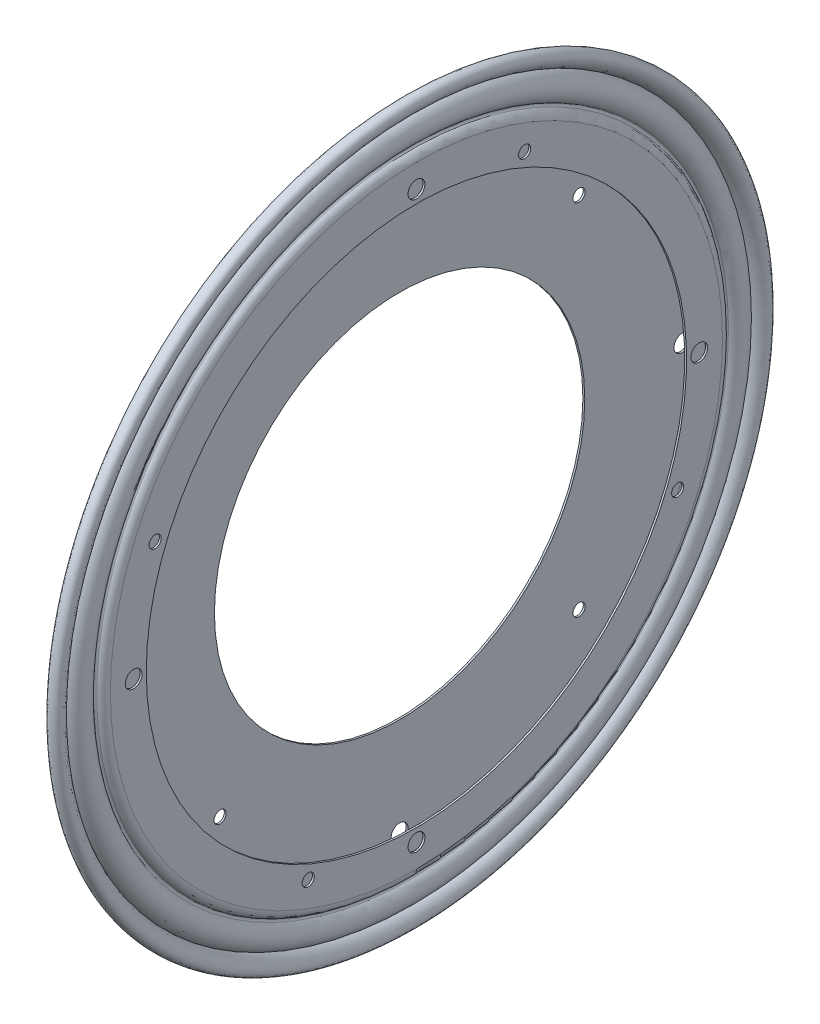
ISO-10303-21;
HEADER;
FILE_DESCRIPTION(('STEP AP214'),'2;1');
FILE_NAME('part.step','',(''),(''),'','','');
FILE_SCHEMA(('AUTOMOTIVE_DESIGN { 1 0 10303 214 1 1 1 1 }'));
ENDSEC;
DATA;
#1=APPLICATION_CONTEXT('core data for automotive mechanical design processes');
#2=APPLICATION_PROTOCOL_DEFINITION('international standard','automotive_design',2000,#1);
#3=PRODUCT_CONTEXT('',#1,'mechanical');
#4=PRODUCT('Part','Part','',(#3));
#5=PRODUCT_RELATED_PRODUCT_CATEGORY('part','',(#4));
#6=PRODUCT_DEFINITION_FORMATION('','',#4);
#7=PRODUCT_DEFINITION_CONTEXT('part definition',#1,'design');
#8=PRODUCT_DEFINITION('design','',#6,#7);
#9=PRODUCT_DEFINITION_SHAPE('','',#8);
#10=(LENGTH_UNIT() NAMED_UNIT(*) SI_UNIT(.MILLI.,.METRE.));
#11=(NAMED_UNIT(*) PLANE_ANGLE_UNIT() SI_UNIT($,.RADIAN.));
#12=(NAMED_UNIT(*) SI_UNIT($,.STERADIAN.) SOLID_ANGLE_UNIT());
#13=UNCERTAINTY_MEASURE_WITH_UNIT(LENGTH_MEASURE(1.E-05),#10,'distance_accuracy_value','');
#14=(GEOMETRIC_REPRESENTATION_CONTEXT(3) GLOBAL_UNCERTAINTY_ASSIGNED_CONTEXT((#13)) GLOBAL_UNIT_ASSIGNED_CONTEXT((#10,
#11,#12)) REPRESENTATION_CONTEXT('',''));
#15=CARTESIAN_POINT('',(0.,0.,0.));
#16=DIRECTION('',(0.,0.,1.));
#17=DIRECTION('',(1.,0.,0.));
#18=AXIS2_PLACEMENT_3D('',#15,#16,#17);
#19=CARTESIAN_POINT('',(-20.7806787586344,-125.372182842589,0.));
#20=DIRECTION('',(1.,0.,0.));
#21=DIRECTION('',(0.,0.,-1.));
#22=AXIS2_PLACEMENT_3D('',#19,#20,#21);
#23=TOROIDAL_SURFACE('',#22,156.907666903698,11.0071865304163);
#24=CARTESIAN_POINT('',(-17.3549548931554,-125.372182842589,0.));
#25=DIRECTION('',(1.,0.,0.));
#26=DIRECTION('',(0.,0.,-1.));
#27=AXIS2_PLACEMENT_3D('',#24,#25,#26);
#28=CIRCLE('',#27,146.447142475503);
#29=CARTESIAN_POINT('',(-17.3549548931554,-125.372182842589,-146.447142475503));
#30=VERTEX_POINT('',#29);
#31=EDGE_CURVE('P0_E10',#30,#30,#28,.T.);
#32=ORIENTED_EDGE('',*,*,#31,.T.);
#33=EDGE_LOOP('',(#32));
#34=FACE_BOUND('',#33,.T.);
#35=CARTESIAN_POINT('',(-17.9016694019906,-125.372182842589,0.));
#36=DIRECTION('',(1.,0.,0.));
#37=DIRECTION('',(0.,0.,-1.));
#38=AXIS2_PLACEMENT_3D('',#35,#36,#37);
#39=CIRCLE('',#38,146.28366292969);
#40=CARTESIAN_POINT('',(-17.9016694019906,-125.372182842589,-146.28366292969));
#41=VERTEX_POINT('',#40);
#42=EDGE_CURVE('P0_E41',#41,#41,#39,.T.);
#43=ORIENTED_EDGE('',*,*,#42,.F.);
#44=EDGE_LOOP('',(#43));
#45=FACE_BOUND('',#44,.T.);
#46=ADVANCED_FACE('P0_F31',(#34,#45),#23,.T.);
#47=CARTESIAN_POINT('',(-17.3549548931554,21.0749596329145,0.));
#48=CARTESIAN_POINT('',(-13.8843389422062,22.21155388043,0.));
#49=CARTESIAN_POINT('',(-13.3298945987826,26.395115924312,0.));
#50=CARTESIAN_POINT('',(-17.2144731093381,27.5448446665488,0.));
#51=CARTESIAN_POINT('',(-17.9016694019901,24.8783484462321,0.));
#52=CARTESIAN_POINT('',(-17.9016694019906,21.801683813341,0.));
#53=B_SPLINE_CURVE_WITH_KNOTS('',3,(#47,#48,#49,#50,#51,#52),.UNSPECIFIED.,.F.,.F.,(4,2,4),(0.,
0.5,1.),.UNSPECIFIED.);
#54=CARTESIAN_POINT('',(-19.8180211094154,-125.372182842589,0.));
#55=DIRECTION('',(1.,0.,0.));
#56=AXIS1_PLACEMENT('',#54,#55);
#57=SURFACE_OF_REVOLUTION('',#53,#56);
#58=CARTESIAN_POINT('',(-17.9016694019906,-125.372182842589,0.));
#59=DIRECTION('',(1.,0.,0.));
#60=DIRECTION('',(0.,0.,-1.));
#61=AXIS2_PLACEMENT_3D('',#58,#59,#60);
#62=CIRCLE('',#61,147.17386665593);
#63=CARTESIAN_POINT('',(-17.9016694019906,-125.372182842589,-147.17386665593));
#64=VERTEX_POINT('',#63);
#65=EDGE_CURVE('P0_E37',#64,#64,#62,.T.);
#66=ORIENTED_EDGE('',*,*,#65,.T.);
#67=EDGE_LOOP('',(#66));
#68=FACE_BOUND('',#67,.T.);
#69=ORIENTED_EDGE('',*,*,#31,.F.);
#70=EDGE_LOOP('',(#69));
#71=FACE_BOUND('',#70,.T.);
#72=ADVANCED_FACE('P0_F53',(#68,#71),#57,.F.);
#73=CARTESIAN_POINT('',(-17.9016694019906,21.8016838133411,0.));
#74=DIRECTION('',(-1.,0.,0.));
#75=DIRECTION('',(0.,0.,1.));
#76=AXIS2_PLACEMENT_3D('',#73,#74,#75);
#77=PLANE('',#76);
#78=ORIENTED_EDGE('',*,*,#42,.T.);
#79=EDGE_LOOP('',(#78));
#80=FACE_BOUND('',#79,.T.);
#81=ORIENTED_EDGE('',*,*,#65,.F.);
#82=EDGE_LOOP('',(#81));
#83=FACE_BOUND('',#82,.T.);
#84=ADVANCED_FACE('P0_F56',(#80,#83),#77,.T.);
#85=CLOSED_SHELL('',(#46,#72,#84));
#86=MANIFOLD_SOLID_BREP('P0_B2',#85);
#87=CARTESIAN_POINT('',(-19.3100196612605,-125.372182842589,0.));
#88=DIRECTION('',(1.,0.,0.));
#89=DIRECTION('',(0.,0.,-1.));
#90=AXIS2_PLACEMENT_3D('',#87,#88,#89);
#91=TOROIDAL_SURFACE('',#90,139.921456642182,6.17720025927117);
#92=CARTESIAN_POINT('',(-17.1079194019906,-125.372182842589,0.));
#93=DIRECTION('',(1.,0.,0.));
#94=DIRECTION('',(0.,1.,0.));
#95=AXIS2_PLACEMENT_3D('',#92,#93,#94);
#96=CIRCLE('',#95,145.692813284364);
#97=CARTESIAN_POINT('',(-17.1079194019906,20.3206304417751,0.));
#98=VERTEX_POINT('',#97);
#99=EDGE_CURVE('P1_E225',#98,#98,#96,.F.);
#100=ORIENTED_EDGE('',*,*,#99,.F.);
#101=EDGE_LOOP('',(#100));
#102=FACE_BOUND('',#101,.T.);
#103=CARTESIAN_POINT('',(-15.4837879251125,-125.372182842589,-4.20150754758772E-13));
#104=DIRECTION('',(1.,0.,0.));
#105=DIRECTION('',(0.,0.,-1.));
#106=AXIS2_PLACEMENT_3D('',#103,#104,#105);
#107=CIRCLE('',#106,135.071945971564);
#108=CARTESIAN_POINT('',(-15.4837879251127,-125.372182842589,-135.071945971565));
#109=VERTEX_POINT('',#108);
#110=EDGE_CURVE('P1_E217',#109,#109,#107,.T.);
#111=ORIENTED_EDGE('',*,*,#110,.F.);
#112=EDGE_LOOP('',(#111));
#113=FACE_BOUND('',#112,.T.);
#114=ADVANCED_FACE('P1_F14',(#102,#113),#91,.T.);
#115=CARTESIAN_POINT('',(-17.1079194019906,20.3206304417751,0.));
#116=CARTESIAN_POINT('',(-13.5609688594263,21.482223370196,0.));
#117=CARTESIAN_POINT('',(-10.2594893705851,27.359305232152,0.));
#118=CARTESIAN_POINT('',(-18.2673052500497,29.8151081640794,0.));
#119=CARTESIAN_POINT('',(-18.8073835861624,24.9252482589153,0.));
#120=CARTESIAN_POINT('',(-18.6954194019905,22.9101467016862,0.));
#121=CARTESIAN_POINT('',(-18.6954194019905,21.801683813341,0.));
#122=(BOUNDED_CURVE() B_SPLINE_CURVE(4,(#115,#116,#117,#118,#119,#120,#121),.UNSPECIFIED.,.F.,
.F.) B_SPLINE_CURVE_WITH_KNOTS((5,1,1,5),(0.,0.579146005992486,0.752139110939153,1.),
.UNSPECIFIED.) CURVE() GEOMETRIC_REPRESENTATION_ITEM() RATIONAL_B_SPLINE_CURVE((1.,1.,1.,1.,1.,
1.,1.)) REPRESENTATION_ITEM(''));
#123=CARTESIAN_POINT('',(-18.6954194019905,-125.372182842589,0.));
#124=DIRECTION('',(1.,0.,0.));
#125=AXIS1_PLACEMENT('',#123,#124);
#126=SURFACE_OF_REVOLUTION('',#122,#125);
#127=ORIENTED_EDGE('',*,*,#99,.T.);
#128=EDGE_LOOP('',(#127));
#129=FACE_BOUND('',#128,.T.);
#130=CARTESIAN_POINT('',(-18.6954194019905,-125.372182842589,0.));
#131=DIRECTION('',(1.,0.,0.));
#132=DIRECTION('',(0.,1.,0.));
#133=AXIS2_PLACEMENT_3D('',#130,#131,#132);
#134=CIRCLE('',#133,147.17386665593);
#135=CARTESIAN_POINT('',(-18.6954194019905,21.801683813341,0.));
#136=VERTEX_POINT('',#135);
#137=EDGE_CURVE('P1_E198',#136,#136,#134,.F.);
#138=ORIENTED_EDGE('',*,*,#137,.F.);
#139=EDGE_LOOP('',(#138));
#140=FACE_BOUND('',#139,.T.);
#141=ADVANCED_FACE('P1_F236',(#129,#140),#126,.F.);
#142=CARTESIAN_POINT('',(-14.9921296797761,-125.372182842589,-3.60822483003176E-13));
#143=DIRECTION('',(1.,0.,0.));
#144=DIRECTION('',(0.,0.,-1.));
#145=AXIS2_PLACEMENT_3D('',#142,#143,#144);
#146=TOROIDAL_SURFACE('',#145,134.448799734881,0.793749999999702);
#147=ORIENTED_EDGE('',*,*,#110,.T.);
#148=EDGE_LOOP('',(#147));
#149=FACE_BOUND('',#148,.T.);
#150=CARTESIAN_POINT('',(-15.344291750717,-125.372182842589,0.));
#151=DIRECTION('',(1.,0.,0.));
#152=DIRECTION('',(0.,0.,-1.));
#153=AXIS2_PLACEMENT_3D('',#150,#151,#152);
#154=CIRCLE('',#153,133.737448247717);
#155=CARTESIAN_POINT('',(-15.344291750717,-125.372182842589,-133.737448247717));
#156=VERTEX_POINT('',#155);
#157=EDGE_CURVE('P1_E195',#156,#156,#154,.T.);
#158=ORIENTED_EDGE('',*,*,#157,.F.);
#159=EDGE_LOOP('',(#158));
#160=FACE_BOUND('',#159,.T.);
#161=ADVANCED_FACE('P1_F240',(#149,#160),#146,.F.);
#162=CARTESIAN_POINT('',(-18.6954194019905,20.6145735626252,0.));
#163=DIRECTION('',(-1.,0.,0.));
#164=DIRECTION('',(0.,0.,1.));
#165=AXIS2_PLACEMENT_3D('',#162,#163,#164);
#166=PLANE('',#165);
#167=CARTESIAN_POINT('',(-18.6954194019905,-125.372182842589,0.));
#168=DIRECTION('',(1.,0.,0.));
#169=DIRECTION('',(0.,0.,-1.));
#170=AXIS2_PLACEMENT_3D('',#167,#168,#169);
#171=CIRCLE('',#170,144.799646154499);
#172=CARTESIAN_POINT('',(-18.6954194019905,-125.372182842589,-144.799646154499));
#173=VERTEX_POINT('',#172);
#174=EDGE_CURVE('P1_E18',#173,#173,#171,.F.);
#175=ORIENTED_EDGE('',*,*,#174,.F.);
#176=EDGE_LOOP('',(#175));
#177=FACE_BOUND('',#176,.T.);
#178=ORIENTED_EDGE('',*,*,#137,.T.);
#179=EDGE_LOOP('',(#178));
#180=FACE_BOUND('',#179,.T.);
#181=ADVANCED_FACE('P1_F188',(#177,#180),#166,.T.);
#182=CARTESIAN_POINT('',(-17.1079194019905,-125.372182842589,0.));
#183=DIRECTION('',(1.,0.,0.));
#184=DIRECTION('',(0.,0.,-1.));
#185=AXIS2_PLACEMENT_3D('',#182,#183,#184);
#186=TOROIDAL_SURFACE('',#185,130.175,3.9751);
#187=ORIENTED_EDGE('',*,*,#157,.T.);
#188=EDGE_LOOP('',(#187));
#189=FACE_BOUND('',#188,.T.);
#190=CARTESIAN_POINT('',(-13.1328194019905,-125.372182842589,0.));
#191=DIRECTION('',(-1.,0.,0.));
#192=DIRECTION('',(0.,1.,0.));
#193=AXIS2_PLACEMENT_3D('',#190,#191,#192);
#194=CIRCLE('',#193,130.175);
#195=CARTESIAN_POINT('',(-13.1328194019905,4.80281715741121,0.));
#196=VERTEX_POINT('',#195);
#197=EDGE_CURVE('P1_E144',#196,#196,#194,.F.);
#198=ORIENTED_EDGE('',*,*,#197,.F.);
#199=EDGE_LOOP('',(#198));
#200=FACE_BOUND('',#199,.T.);
#201=ADVANCED_FACE('P1_F183',(#189,#200),#186,.T.);
#202=CARTESIAN_POINT('',(-14.9058191427206,-125.372182842589,0.));
#203=DIRECTION('',(1.,0.,0.));
#204=DIRECTION('',(0.,0.,-1.));
#205=AXIS2_PLACEMENT_3D('',#202,#203,#204);
#206=TOROIDAL_SURFACE('',#205,139.921456642182,6.17720025927117);
#207=CARTESIAN_POINT('',(-18.7320508788683,-125.372182842589,-7.98234008933115E-13));
#208=DIRECTION('',(-1.,0.,0.));
#209=DIRECTION('',(0.,0.,1.));
#210=AXIS2_PLACEMENT_3D('',#207,#208,#209);
#211=CIRCLE('',#210,135.071945971565);
#212=CARTESIAN_POINT('',(-18.7320508788681,-125.372182842589,135.071945971564));
#213=VERTEX_POINT('',#212);
#214=EDGE_CURVE('P1_E140',#213,#213,#211,.T.);
#215=ORIENTED_EDGE('',*,*,#214,.F.);
#216=EDGE_LOOP('',(#215));
#217=FACE_BOUND('',#216,.T.);
#218=ORIENTED_EDGE('',*,*,#174,.T.);
#219=EDGE_LOOP('',(#218));
#220=FACE_BOUND('',#219,.T.);
#221=ADVANCED_FACE('P1_F177',(#217,#220),#206,.T.);
#222=CARTESIAN_POINT('',(-13.1328194019906,-60.2846828425888,0.));
#223=DIRECTION('',(1.,0.,0.));
#224=DIRECTION('',(0.,0.,-1.));
#225=AXIS2_PLACEMENT_3D('',#222,#223,#224);
#226=PLANE('',#225);
#227=CARTESIAN_POINT('',(-13.1328194019906,-125.372182842589,0.));
#228=DIRECTION('',(-1.,0.,0.));
#229=DIRECTION('',(0.,0.,1.));
#230=AXIS2_PLACEMENT_3D('',#227,#228,#229);
#231=CIRCLE('',#230,114.8969);
#232=CARTESIAN_POINT('',(-13.1328194019906,-125.372182842589,114.8969));
#233=VERTEX_POINT('',#232);
#234=EDGE_CURVE('P1_E115',#233,#233,#231,.T.);
#235=ORIENTED_EDGE('',*,*,#234,.T.);
#236=EDGE_LOOP('',(#235));
#237=FACE_BOUND('',#236,.T.);
#238=CARTESIAN_POINT('',(-13.1328194019906,-5.11588284258878,0.));
#239=DIRECTION('',(1.,0.,0.));
#240=DIRECTION('',(0.,0.,-1.));
#241=AXIS2_PLACEMENT_3D('',#238,#239,#240);
#242=CIRCLE('',#241,3.5687);
#243=CARTESIAN_POINT('',(-13.1328194019906,-5.11588284258878,-3.5687));
#244=VERTEX_POINT('',#243);
#245=EDGE_CURVE('P1_E118',#244,#244,#242,.F.);
#246=ORIENTED_EDGE('',*,*,#245,.T.);
#247=EDGE_LOOP('',(#246));
#248=FACE_BOUND('',#247,.T.);
#249=CARTESIAN_POINT('',(-13.1328194019906,-125.372182842589,-120.2563));
#250=DIRECTION('',(1.,0.,0.));
#251=DIRECTION('',(0.,0.,-1.));
#252=AXIS2_PLACEMENT_3D('',#249,#250,#251);
#253=CIRCLE('',#252,3.56869999999997);
#254=CARTESIAN_POINT('',(-13.1328194019906,-125.372182842589,-123.825));
#255=VERTEX_POINT('',#254);
#256=EDGE_CURVE('P1_E121',#255,#255,#253,.F.);
#257=ORIENTED_EDGE('',*,*,#256,.T.);
#258=EDGE_LOOP('',(#257));
#259=FACE_BOUND('',#258,.T.);
#260=CARTESIAN_POINT('',(-13.1328194019906,-245.628482842589,0.));
#261=DIRECTION('',(1.,0.,0.));
#262=DIRECTION('',(0.,0.,-1.));
#263=AXIS2_PLACEMENT_3D('',#260,#261,#262);
#264=CIRCLE('',#263,3.56870000000005);
#265=CARTESIAN_POINT('',(-13.1328194019906,-245.628482842589,-3.5687));
#266=VERTEX_POINT('',#265);
#267=EDGE_CURVE('P1_E124',#266,#266,#264,.F.);
#268=ORIENTED_EDGE('',*,*,#267,.T.);
#269=EDGE_LOOP('',(#268));
#270=FACE_BOUND('',#269,.T.);
#271=CARTESIAN_POINT('',(-13.1328194019906,-125.372182842589,120.2563));
#272=DIRECTION('',(1.,0.,0.));
#273=DIRECTION('',(0.,0.,-1.));
#274=AXIS2_PLACEMENT_3D('',#271,#272,#273);
#275=CIRCLE('',#274,3.56869999999992);
#276=CARTESIAN_POINT('',(-13.1328194019906,-125.372182842589,116.6876));
#277=VERTEX_POINT('',#276);
#278=EDGE_CURVE('P1_E127',#277,#277,#275,.F.);
#279=ORIENTED_EDGE('',*,*,#278,.T.);
#280=EDGE_LOOP('',(#279));
#281=FACE_BOUND('',#280,.T.);
#282=CARTESIAN_POINT('',(-13.1328194019906,-14.2698486170517,-46.0200936475259));
#283=DIRECTION('',(1.,0.,0.));
#284=DIRECTION('',(0.,0.,-1.));
#285=AXIS2_PLACEMENT_3D('',#282,#283,#284);
#286=CIRCLE('',#285,2.57809999999995);
#287=CARTESIAN_POINT('',(-13.1328194019906,-14.2698486170517,-48.5981936475259));
#288=VERTEX_POINT('',#287);
#289=EDGE_CURVE('P1_E130',#288,#288,#286,.F.);
#290=ORIENTED_EDGE('',*,*,#289,.T.);
#291=EDGE_LOOP('',(#290));
#292=FACE_BOUND('',#291,.T.);
#293=CARTESIAN_POINT('',(-13.1328194019906,-171.392276490115,-111.102334225537));
#294=DIRECTION('',(1.,0.,0.));
#295=DIRECTION('',(0.,0.,-1.));
#296=AXIS2_PLACEMENT_3D('',#293,#294,#295);
#297=CIRCLE('',#296,2.5781);
#298=CARTESIAN_POINT('',(-13.1328194019906,-171.392276490115,-113.680434225537));
#299=VERTEX_POINT('',#298);
#300=EDGE_CURVE('P1_E133',#299,#299,#297,.F.);
#301=ORIENTED_EDGE('',*,*,#300,.T.);
#302=EDGE_LOOP('',(#301));
#303=FACE_BOUND('',#302,.T.);
#304=CARTESIAN_POINT('',(-13.1328194019906,-236.474517068126,46.0200936475259));
#305=DIRECTION('',(1.,0.,0.));
#306=DIRECTION('',(0.,0.,-1.));
#307=AXIS2_PLACEMENT_3D('',#304,#305,#306);
#308=CIRCLE('',#307,2.57809999999995);
#309=CARTESIAN_POINT('',(-13.1328194019906,-236.474517068126,43.441993647526));
#310=VERTEX_POINT('',#309);
#311=EDGE_CURVE('P1_E136',#310,#310,#308,.F.);
#312=ORIENTED_EDGE('',*,*,#311,.T.);
#313=EDGE_LOOP('',(#312));
#314=FACE_BOUND('',#313,.T.);
#315=CARTESIAN_POINT('',(-13.1328194019906,-79.3520891950629,111.102334225537));
#316=DIRECTION('',(1.,0.,0.));
#317=DIRECTION('',(0.,0.,-1.));
#318=AXIS2_PLACEMENT_3D('',#315,#316,#317);
#319=CIRCLE('',#318,2.57810000000005);
#320=CARTESIAN_POINT('',(-13.1328194019906,-79.3520891950629,108.524234225537));
#321=VERTEX_POINT('',#320);
#322=EDGE_CURVE('P1_E138',#321,#321,#319,.F.);
#323=ORIENTED_EDGE('',*,*,#322,.T.);
#324=EDGE_LOOP('',(#323));
#325=FACE_BOUND('',#324,.T.);
#326=ORIENTED_EDGE('',*,*,#197,.T.);
#327=EDGE_LOOP('',(#326));
#328=FACE_BOUND('',#327,.T.);
#329=ADVANCED_FACE('P1_F166',(#237,#248,#259,#270,#281,#292,#303,#314,#325,#328),#226,.T.);
#330=CARTESIAN_POINT('',(-19.2237091242057,-125.372182842589,-8.04911692853238E-13));
#331=DIRECTION('',(1.,0.,0.));
#332=DIRECTION('',(0.,0.,-1.));
#333=AXIS2_PLACEMENT_3D('',#330,#331,#332);
#334=TOROIDAL_SURFACE('',#333,134.448799734881,0.793750000000423);
#335=CARTESIAN_POINT('',(-18.8715470532641,-125.372182842589,0.));
#336=DIRECTION('',(1.,0.,0.));
#337=DIRECTION('',(0.,0.,-1.));
#338=AXIS2_PLACEMENT_3D('',#335,#336,#337);
#339=CIRCLE('',#338,133.737448247717);
#340=CARTESIAN_POINT('',(-18.8715470532641,-125.372182842589,-133.737448247717));
#341=VERTEX_POINT('',#340);
#342=EDGE_CURVE('P1_E114',#341,#341,#339,.F.);
#343=ORIENTED_EDGE('',*,*,#342,.F.);
#344=EDGE_LOOP('',(#343));
#345=FACE_BOUND('',#344,.T.);
#346=ORIENTED_EDGE('',*,*,#214,.T.);
#347=EDGE_LOOP('',(#346));
#348=FACE_BOUND('',#347,.T.);
#349=ADVANCED_FACE('P1_F176',(#345,#348),#334,.F.);
#350=CARTESIAN_POINT('',(-13.5296944019906,-79.3520891950629,111.102334225537));
#351=DIRECTION('',(1.,0.,0.));
#352=DIRECTION('',(0.,0.,-1.));
#353=AXIS2_PLACEMENT_3D('',#350,#351,#352);
#354=CYLINDRICAL_SURFACE('',#353,2.57810000000005);
#355=CARTESIAN_POINT('',(-13.9265694019906,-79.3520891950629,111.102334225537));
#356=DIRECTION('',(1.,0.,0.));
#357=DIRECTION('',(0.,0.,-1.));
#358=AXIS2_PLACEMENT_3D('',#355,#356,#357);
#359=CIRCLE('',#358,2.57810000000005);
#360=CARTESIAN_POINT('',(-13.9265694019906,-79.3520891950629,108.524234225537));
#361=VERTEX_POINT('',#360);
#362=EDGE_CURVE('P1_E111',#361,#361,#359,.T.);
#363=ORIENTED_EDGE('',*,*,#362,.F.);
#364=EDGE_LOOP('',(#363));
#365=FACE_BOUND('',#364,.T.);
#366=ORIENTED_EDGE('',*,*,#322,.F.);
#367=EDGE_LOOP('',(#366));
#368=FACE_BOUND('',#367,.T.);
#369=ADVANCED_FACE('P1_F179',(#365,#368),#354,.F.);
#370=CARTESIAN_POINT('',(-13.5296944019906,-236.474517068126,46.0200936475259));
#371=DIRECTION('',(1.,0.,0.));
#372=DIRECTION('',(0.,0.,-1.));
#373=AXIS2_PLACEMENT_3D('',#370,#371,#372);
#374=CYLINDRICAL_SURFACE('',#373,2.57809999999995);
#375=CARTESIAN_POINT('',(-13.9265694019906,-236.474517068126,46.0200936475259));
#376=DIRECTION('',(1.,0.,0.));
#377=DIRECTION('',(0.,0.,-1.));
#378=AXIS2_PLACEMENT_3D('',#375,#376,#377);
#379=CIRCLE('',#378,2.57809999999995);
#380=CARTESIAN_POINT('',(-13.9265694019906,-236.474517068126,43.441993647526));
#381=VERTEX_POINT('',#380);
#382=EDGE_CURVE('P1_E108',#381,#381,#379,.T.);
#383=ORIENTED_EDGE('',*,*,#382,.F.);
#384=EDGE_LOOP('',(#383));
#385=FACE_BOUND('',#384,.T.);
#386=ORIENTED_EDGE('',*,*,#311,.F.);
#387=EDGE_LOOP('',(#386));
#388=FACE_BOUND('',#387,.T.);
#389=ADVANCED_FACE('P1_F261',(#385,#388),#374,.F.);
#390=CARTESIAN_POINT('',(-13.5296944019906,-171.392276490115,-111.102334225537));
#391=DIRECTION('',(1.,0.,0.));
#392=DIRECTION('',(0.,0.,-1.));
#393=AXIS2_PLACEMENT_3D('',#390,#391,#392);
#394=CYLINDRICAL_SURFACE('',#393,2.5781);
#395=CARTESIAN_POINT('',(-13.9265694019906,-171.392276490115,-111.102334225537));
#396=DIRECTION('',(1.,0.,0.));
#397=DIRECTION('',(0.,0.,-1.));
#398=AXIS2_PLACEMENT_3D('',#395,#396,#397);
#399=CIRCLE('',#398,2.5781);
#400=CARTESIAN_POINT('',(-13.9265694019906,-171.392276490115,-113.680434225537));
#401=VERTEX_POINT('',#400);
#402=EDGE_CURVE('P1_E105',#401,#401,#399,.T.);
#403=ORIENTED_EDGE('',*,*,#402,.F.);
#404=EDGE_LOOP('',(#403));
#405=FACE_BOUND('',#404,.T.);
#406=ORIENTED_EDGE('',*,*,#300,.F.);
#407=EDGE_LOOP('',(#406));
#408=FACE_BOUND('',#407,.T.);
#409=ADVANCED_FACE('P1_F355',(#405,#408),#394,.F.);
#410=CARTESIAN_POINT('',(-13.5296944019906,-14.2698486170517,-46.0200936475259));
#411=DIRECTION('',(1.,0.,0.));
#412=DIRECTION('',(0.,0.,-1.));
#413=AXIS2_PLACEMENT_3D('',#410,#411,#412);
#414=CYLINDRICAL_SURFACE('',#413,2.57809999999995);
#415=CARTESIAN_POINT('',(-13.9265694019906,-14.2698486170517,-46.0200936475259));
#416=DIRECTION('',(1.,0.,0.));
#417=DIRECTION('',(0.,0.,-1.));
#418=AXIS2_PLACEMENT_3D('',#415,#416,#417);
#419=CIRCLE('',#418,2.57809999999995);
#420=CARTESIAN_POINT('',(-13.9265694019906,-14.2698486170517,-48.5981936475259));
#421=VERTEX_POINT('',#420);
#422=EDGE_CURVE('P1_E102',#421,#421,#419,.T.);
#423=ORIENTED_EDGE('',*,*,#422,.F.);
#424=EDGE_LOOP('',(#423));
#425=FACE_BOUND('',#424,.T.);
#426=ORIENTED_EDGE('',*,*,#289,.F.);
#427=EDGE_LOOP('',(#426));
#428=FACE_BOUND('',#427,.T.);
#429=ADVANCED_FACE('P1_F351',(#425,#428),#414,.F.);
#430=CARTESIAN_POINT('',(-13.5296944019906,-125.372182842589,120.2563));
#431=DIRECTION('',(1.,0.,0.));
#432=DIRECTION('',(0.,0.,-1.));
#433=AXIS2_PLACEMENT_3D('',#430,#431,#432);
#434=CYLINDRICAL_SURFACE('',#433,3.56869999999992);
#435=CARTESIAN_POINT('',(-13.9265694019906,-125.372182842589,120.2563));
#436=DIRECTION('',(1.,0.,0.));
#437=DIRECTION('',(0.,0.,-1.));
#438=AXIS2_PLACEMENT_3D('',#435,#436,#437);
#439=CIRCLE('',#438,3.56869999999992);
#440=CARTESIAN_POINT('',(-13.9265694019906,-125.372182842589,116.6876));
#441=VERTEX_POINT('',#440);
#442=EDGE_CURVE('P1_E99',#441,#441,#439,.T.);
#443=ORIENTED_EDGE('',*,*,#442,.F.);
#444=EDGE_LOOP('',(#443));
#445=FACE_BOUND('',#444,.T.);
#446=ORIENTED_EDGE('',*,*,#278,.F.);
#447=EDGE_LOOP('',(#446));
#448=FACE_BOUND('',#447,.T.);
#449=ADVANCED_FACE('P1_F347',(#445,#448),#434,.F.);
#450=CARTESIAN_POINT('',(-13.5296944019906,-245.628482842589,0.));
#451=DIRECTION('',(1.,0.,0.));
#452=DIRECTION('',(0.,0.,-1.));
#453=AXIS2_PLACEMENT_3D('',#450,#451,#452);
#454=CYLINDRICAL_SURFACE('',#453,3.56870000000005);
#455=CARTESIAN_POINT('',(-13.9265694019906,-245.628482842589,0.));
#456=DIRECTION('',(1.,0.,0.));
#457=DIRECTION('',(0.,0.,-1.));
#458=AXIS2_PLACEMENT_3D('',#455,#456,#457);
#459=CIRCLE('',#458,3.56870000000005);
#460=CARTESIAN_POINT('',(-13.9265694019906,-245.628482842589,-3.5687));
#461=VERTEX_POINT('',#460);
#462=EDGE_CURVE('P1_E96',#461,#461,#459,.T.);
#463=ORIENTED_EDGE('',*,*,#462,.F.);
#464=EDGE_LOOP('',(#463));
#465=FACE_BOUND('',#464,.T.);
#466=ORIENTED_EDGE('',*,*,#267,.F.);
#467=EDGE_LOOP('',(#466));
#468=FACE_BOUND('',#467,.T.);
#469=ADVANCED_FACE('P1_F343',(#465,#468),#454,.F.);
#470=CARTESIAN_POINT('',(-13.5296944019906,-125.372182842589,-120.2563));
#471=DIRECTION('',(1.,0.,0.));
#472=DIRECTION('',(0.,0.,-1.));
#473=AXIS2_PLACEMENT_3D('',#470,#471,#472);
#474=CYLINDRICAL_SURFACE('',#473,3.56869999999997);
#475=CARTESIAN_POINT('',(-13.9265694019906,-125.372182842589,-120.2563));
#476=DIRECTION('',(1.,0.,0.));
#477=DIRECTION('',(0.,0.,-1.));
#478=AXIS2_PLACEMENT_3D('',#475,#476,#477);
#479=CIRCLE('',#478,3.56869999999997);
#480=CARTESIAN_POINT('',(-13.9265694019906,-125.372182842589,-123.825));
#481=VERTEX_POINT('',#480);
#482=EDGE_CURVE('P1_E93',#481,#481,#479,.T.);
#483=ORIENTED_EDGE('',*,*,#482,.F.);
#484=EDGE_LOOP('',(#483));
#485=FACE_BOUND('',#484,.T.);
#486=ORIENTED_EDGE('',*,*,#256,.F.);
#487=EDGE_LOOP('',(#486));
#488=FACE_BOUND('',#487,.T.);
#489=ADVANCED_FACE('P1_F339',(#485,#488),#474,.F.);
#490=CARTESIAN_POINT('',(-13.5296944019906,-5.11588284258878,0.));
#491=DIRECTION('',(1.,0.,0.));
#492=DIRECTION('',(0.,0.,-1.));
#493=AXIS2_PLACEMENT_3D('',#490,#491,#492);
#494=CYLINDRICAL_SURFACE('',#493,3.5687);
#495=CARTESIAN_POINT('',(-13.9265694019906,-5.11588284258878,0.));
#496=DIRECTION('',(1.,0.,0.));
#497=DIRECTION('',(0.,0.,-1.));
#498=AXIS2_PLACEMENT_3D('',#495,#496,#497);
#499=CIRCLE('',#498,3.5687);
#500=CARTESIAN_POINT('',(-13.9265694019906,-5.11588284258878,-3.5687));
#501=VERTEX_POINT('',#500);
#502=EDGE_CURVE('P1_E90',#501,#501,#499,.T.);
#503=ORIENTED_EDGE('',*,*,#502,.F.);
#504=EDGE_LOOP('',(#503));
#505=FACE_BOUND('',#504,.T.);
#506=ORIENTED_EDGE('',*,*,#245,.F.);
#507=EDGE_LOOP('',(#506));
#508=FACE_BOUND('',#507,.T.);
#509=ADVANCED_FACE('P1_F335',(#505,#508),#494,.F.);
#510=CARTESIAN_POINT('',(-13.1328194019906,-125.372182842589,0.));
#511=DIRECTION('',(-1.,0.,0.));
#512=DIRECTION('',(0.,0.,1.));
#513=AXIS2_PLACEMENT_3D('',#510,#511,#512);
#514=CYLINDRICAL_SURFACE('',#513,114.8969);
#515=CARTESIAN_POINT('',(-13.9265694019906,-125.372182842589,0.));
#516=DIRECTION('',(-1.,0.,0.));
#517=DIRECTION('',(0.,0.,1.));
#518=AXIS2_PLACEMENT_3D('',#515,#516,#517);
#519=CIRCLE('',#518,114.8969);
#520=CARTESIAN_POINT('',(-13.9265694019906,-125.372182842589,114.8969));
#521=VERTEX_POINT('',#520);
#522=EDGE_CURVE('P1_E87',#521,#521,#519,.F.);
#523=ORIENTED_EDGE('',*,*,#522,.F.);
#524=EDGE_LOOP('',(#523));
#525=FACE_BOUND('',#524,.T.);
#526=ORIENTED_EDGE('',*,*,#234,.F.);
#527=EDGE_LOOP('',(#526));
#528=FACE_BOUND('',#527,.T.);
#529=ADVANCED_FACE('P1_F331',(#525,#528),#514,.F.);
#530=CARTESIAN_POINT('',(-17.1079194019905,-125.372182842589,0.));
#531=DIRECTION('',(1.,0.,0.));
#532=DIRECTION('',(0.,0.,-1.));
#533=AXIS2_PLACEMENT_3D('',#530,#531,#532);
#534=TOROIDAL_SURFACE('',#533,130.175,3.97509999999998);
#535=CARTESIAN_POINT('',(-21.0830194019905,-125.372182842589,0.));
#536=DIRECTION('',(1.,0.,0.));
#537=DIRECTION('',(0.,1.,0.));
#538=AXIS2_PLACEMENT_3D('',#535,#536,#537);
#539=CIRCLE('',#538,130.175);
#540=CARTESIAN_POINT('',(-21.0830194019905,4.80281715741121,0.));
#541=VERTEX_POINT('',#540);
#542=EDGE_CURVE('P1_E86',#541,#541,#539,.F.);
#543=ORIENTED_EDGE('',*,*,#542,.F.);
#544=EDGE_LOOP('',(#543));
#545=FACE_BOUND('',#544,.T.);
#546=ORIENTED_EDGE('',*,*,#342,.T.);
#547=EDGE_LOOP('',(#546));
#548=FACE_BOUND('',#547,.T.);
#549=ADVANCED_FACE('P1_F327',(#545,#548),#534,.T.);
#550=CARTESIAN_POINT('',(-13.9265694019906,-60.2846828425888,0.));
#551=DIRECTION('',(-1.,0.,0.));
#552=DIRECTION('',(0.,0.,1.));
#553=AXIS2_PLACEMENT_3D('',#550,#551,#552);
#554=PLANE('',#553);
#555=ORIENTED_EDGE('',*,*,#522,.T.);
#556=EDGE_LOOP('',(#555));
#557=FACE_BOUND('',#556,.T.);
#558=ORIENTED_EDGE('',*,*,#502,.T.);
#559=EDGE_LOOP('',(#558));
#560=FACE_BOUND('',#559,.T.);
#561=ORIENTED_EDGE('',*,*,#482,.T.);
#562=EDGE_LOOP('',(#561));
#563=FACE_BOUND('',#562,.T.);
#564=ORIENTED_EDGE('',*,*,#462,.T.);
#565=EDGE_LOOP('',(#564));
#566=FACE_BOUND('',#565,.T.);
#567=ORIENTED_EDGE('',*,*,#442,.T.);
#568=EDGE_LOOP('',(#567));
#569=FACE_BOUND('',#568,.T.);
#570=ORIENTED_EDGE('',*,*,#422,.T.);
#571=EDGE_LOOP('',(#570));
#572=FACE_BOUND('',#571,.T.);
#573=ORIENTED_EDGE('',*,*,#402,.T.);
#574=EDGE_LOOP('',(#573));
#575=FACE_BOUND('',#574,.T.);
#576=ORIENTED_EDGE('',*,*,#382,.T.);
#577=EDGE_LOOP('',(#576));
#578=FACE_BOUND('',#577,.T.);
#579=ORIENTED_EDGE('',*,*,#362,.T.);
#580=EDGE_LOOP('',(#579));
#581=FACE_BOUND('',#580,.T.);
#582=CARTESIAN_POINT('',(-13.9265694019906,-125.372182842589,0.));
#583=DIRECTION('',(1.,0.,0.));
#584=DIRECTION('',(0.,0.,-1.));
#585=AXIS2_PLACEMENT_3D('',#582,#583,#584);
#586=CIRCLE('',#585,130.175);
#587=CARTESIAN_POINT('',(-13.9265694019903,-125.372182842589,-130.175));
#588=VERTEX_POINT('',#587);
#589=EDGE_CURVE('P1_E83',#588,#588,#586,.T.);
#590=ORIENTED_EDGE('',*,*,#589,.F.);
#591=EDGE_LOOP('',(#590));
#592=FACE_BOUND('',#591,.T.);
#593=ADVANCED_FACE('P1_F311',(#557,#560,#563,#566,#569,#572,#575,#578,#581,#592),#554,.T.);
#594=CARTESIAN_POINT('',(-21.0830194019906,-60.2846828425888,0.));
#595=DIRECTION('',(-1.,0.,0.));
#596=DIRECTION('',(0.,0.,1.));
#597=AXIS2_PLACEMENT_3D('',#594,#595,#596);
#598=PLANE('',#597);
#599=CARTESIAN_POINT('',(-21.0830194019906,-49.0400058135011,76.3321770290878));
#600=DIRECTION('',(1.,0.,0.));
#601=DIRECTION('',(0.,0.,-1.));
#602=AXIS2_PLACEMENT_3D('',#599,#600,#601);
#603=CIRCLE('',#602,2.5781);
#604=CARTESIAN_POINT('',(-21.0830194019906,-49.0400058135011,73.7540770290878));
#605=VERTEX_POINT('',#604);
#606=EDGE_CURVE('P1_E56',#605,#605,#603,.T.);
#607=ORIENTED_EDGE('',*,*,#606,.T.);
#608=EDGE_LOOP('',(#607));
#609=FACE_BOUND('',#608,.T.);
#610=CARTESIAN_POINT('',(-21.0830194019906,-201.704359871677,76.3321770290878));
#611=DIRECTION('',(1.,0.,0.));
#612=DIRECTION('',(0.,0.,-1.));
#613=AXIS2_PLACEMENT_3D('',#610,#611,#612);
#614=CIRCLE('',#613,2.5781);
#615=CARTESIAN_POINT('',(-21.0830194019906,-201.704359871677,73.7540770290878));
#616=VERTEX_POINT('',#615);
#617=EDGE_CURVE('P1_E59',#616,#616,#614,.T.);
#618=ORIENTED_EDGE('',*,*,#617,.T.);
#619=EDGE_LOOP('',(#618));
#620=FACE_BOUND('',#619,.T.);
#621=CARTESIAN_POINT('',(-21.0830194019906,-201.704359871677,-76.3321770290879));
#622=DIRECTION('',(1.,0.,0.));
#623=DIRECTION('',(0.,0.,-1.));
#624=AXIS2_PLACEMENT_3D('',#621,#622,#623);
#625=CIRCLE('',#624,2.5781);
#626=CARTESIAN_POINT('',(-21.0830194019906,-201.704359871677,-78.9102770290879));
#627=VERTEX_POINT('',#626);
#628=EDGE_CURVE('P1_E62',#627,#627,#625,.T.);
#629=ORIENTED_EDGE('',*,*,#628,.T.);
#630=EDGE_LOOP('',(#629));
#631=FACE_BOUND('',#630,.T.);
#632=CARTESIAN_POINT('',(-21.0830194019906,-49.040005813501,-76.3321770290878));
#633=DIRECTION('',(1.,0.,0.));
#634=DIRECTION('',(0.,0.,-1.));
#635=AXIS2_PLACEMENT_3D('',#632,#633,#634);
#636=CIRCLE('',#635,2.5781);
#637=CARTESIAN_POINT('',(-21.0830194019906,-49.040005813501,-78.9102770290878));
#638=VERTEX_POINT('',#637);
#639=EDGE_CURVE('P1_E65',#638,#638,#636,.T.);
#640=ORIENTED_EDGE('',*,*,#639,.T.);
#641=EDGE_LOOP('',(#640));
#642=FACE_BOUND('',#641,.T.);
#643=CARTESIAN_POINT('',(-21.0830194019906,-125.372182842589,120.2563));
#644=DIRECTION('',(1.,0.,0.));
#645=DIRECTION('',(0.,0.,-1.));
#646=AXIS2_PLACEMENT_3D('',#643,#644,#645);
#647=CIRCLE('',#646,3.56869999999992);
#648=CARTESIAN_POINT('',(-21.0830194019906,-125.372182842589,116.6876));
#649=VERTEX_POINT('',#648);
#650=EDGE_CURVE('P1_E68',#649,#649,#647,.T.);
#651=ORIENTED_EDGE('',*,*,#650,.T.);
#652=EDGE_LOOP('',(#651));
#653=FACE_BOUND('',#652,.T.);
#654=CARTESIAN_POINT('',(-21.0830194019906,-245.628482842589,0.));
#655=DIRECTION('',(1.,0.,0.));
#656=DIRECTION('',(0.,0.,-1.));
#657=AXIS2_PLACEMENT_3D('',#654,#655,#656);
#658=CIRCLE('',#657,3.56870000000005);
#659=CARTESIAN_POINT('',(-21.0830194019906,-245.628482842589,-3.5687));
#660=VERTEX_POINT('',#659);
#661=EDGE_CURVE('P1_E71',#660,#660,#658,.T.);
#662=ORIENTED_EDGE('',*,*,#661,.T.);
#663=EDGE_LOOP('',(#662));
#664=FACE_BOUND('',#663,.T.);
#665=CARTESIAN_POINT('',(-21.0830194019906,-125.372182842589,-120.2563));
#666=DIRECTION('',(1.,0.,0.));
#667=DIRECTION('',(0.,0.,-1.));
#668=AXIS2_PLACEMENT_3D('',#665,#666,#667);
#669=CIRCLE('',#668,3.56869999999997);
#670=CARTESIAN_POINT('',(-21.0830194019906,-125.372182842589,-123.825));
#671=VERTEX_POINT('',#670);
#672=EDGE_CURVE('P1_E74',#671,#671,#669,.T.);
#673=ORIENTED_EDGE('',*,*,#672,.T.);
#674=EDGE_LOOP('',(#673));
#675=FACE_BOUND('',#674,.T.);
#676=CARTESIAN_POINT('',(-21.0830194019906,-5.11588284258878,0.));
#677=DIRECTION('',(1.,0.,0.));
#678=DIRECTION('',(0.,0.,-1.));
#679=AXIS2_PLACEMENT_3D('',#676,#677,#678);
#680=CIRCLE('',#679,3.5687);
#681=CARTESIAN_POINT('',(-21.0830194019906,-5.11588284258878,-3.5687));
#682=VERTEX_POINT('',#681);
#683=EDGE_CURVE('P1_E77',#682,#682,#680,.T.);
#684=ORIENTED_EDGE('',*,*,#683,.T.);
#685=EDGE_LOOP('',(#684));
#686=FACE_BOUND('',#685,.T.);
#687=CARTESIAN_POINT('',(-21.0830194019906,-125.372182842589,0.));
#688=DIRECTION('',(-1.,0.,0.));
#689=DIRECTION('',(0.,0.,1.));
#690=AXIS2_PLACEMENT_3D('',#687,#688,#689);
#691=CIRCLE('',#690,78.7527);
#692=CARTESIAN_POINT('',(-21.0830194019906,-125.372182842589,78.7527));
#693=VERTEX_POINT('',#692);
#694=EDGE_CURVE('P1_E80',#693,#693,#691,.F.);
#695=ORIENTED_EDGE('',*,*,#694,.T.);
#696=EDGE_LOOP('',(#695));
#697=FACE_BOUND('',#696,.T.);
#698=ORIENTED_EDGE('',*,*,#542,.T.);
#699=EDGE_LOOP('',(#698));
#700=FACE_BOUND('',#699,.T.);
#701=ADVANCED_FACE('P1_F307',(#609,#620,#631,#642,#653,#664,#675,#686,#697,#700),#598,.T.);
#702=CARTESIAN_POINT('',(-17.1079194019905,-125.372182842589,0.));
#703=DIRECTION('',(1.,0.,0.));
#704=DIRECTION('',(0.,0.,-1.));
#705=AXIS2_PLACEMENT_3D('',#702,#703,#704);
#706=TOROIDAL_SURFACE('',#705,130.175,3.18134999999992);
#707=ORIENTED_EDGE('',*,*,#589,.T.);
#708=EDGE_LOOP('',(#707));
#709=FACE_BOUND('',#708,.T.);
#710=CARTESIAN_POINT('',(-20.2892694019904,-125.372182842589,0.));
#711=DIRECTION('',(1.,0.,0.));
#712=DIRECTION('',(0.,0.,-1.));
#713=AXIS2_PLACEMENT_3D('',#710,#711,#712);
#714=CIRCLE('',#713,130.175);
#715=CARTESIAN_POINT('',(-20.2892694019902,-125.372182842589,-130.175));
#716=VERTEX_POINT('',#715);
#717=EDGE_CURVE('P1_E53',#716,#716,#714,.T.);
#718=ORIENTED_EDGE('',*,*,#717,.F.);
#719=EDGE_LOOP('',(#718));
#720=FACE_BOUND('',#719,.T.);
#721=ADVANCED_FACE('P1_F16',(#709,#720),#706,.F.);
#722=CARTESIAN_POINT('',(-20.2892694019906,-125.372182842589,0.));
#723=DIRECTION('',(-1.,0.,0.));
#724=DIRECTION('',(0.,0.,1.));
#725=AXIS2_PLACEMENT_3D('',#722,#723,#724);
#726=CYLINDRICAL_SURFACE('',#725,78.7527);
#727=CARTESIAN_POINT('',(-20.2892694019906,-125.372182842589,0.));
#728=DIRECTION('',(-1.,0.,0.));
#729=DIRECTION('',(0.,0.,1.));
#730=AXIS2_PLACEMENT_3D('',#727,#728,#729);
#731=CIRCLE('',#730,78.7527);
#732=CARTESIAN_POINT('',(-20.2892694019906,-125.372182842589,78.7527));
#733=VERTEX_POINT('',#732);
#734=EDGE_CURVE('P1_E50',#733,#733,#731,.T.);
#735=ORIENTED_EDGE('',*,*,#734,.F.);
#736=EDGE_LOOP('',(#735));
#737=FACE_BOUND('',#736,.T.);
#738=ORIENTED_EDGE('',*,*,#694,.F.);
#739=EDGE_LOOP('',(#738));
#740=FACE_BOUND('',#739,.T.);
#741=ADVANCED_FACE('P1_F302',(#737,#740),#726,.F.);
#742=CARTESIAN_POINT('',(-20.6861444019906,-5.11588284258878,0.));
#743=DIRECTION('',(1.,0.,0.));
#744=DIRECTION('',(0.,0.,-1.));
#745=AXIS2_PLACEMENT_3D('',#742,#743,#744);
#746=CYLINDRICAL_SURFACE('',#745,3.5687);
#747=ORIENTED_EDGE('',*,*,#683,.F.);
#748=EDGE_LOOP('',(#747));
#749=FACE_BOUND('',#748,.T.);
#750=CARTESIAN_POINT('',(-20.2892694019906,-5.11588284258878,0.));
#751=DIRECTION('',(1.,0.,0.));
#752=DIRECTION('',(0.,0.,-1.));
#753=AXIS2_PLACEMENT_3D('',#750,#751,#752);
#754=CIRCLE('',#753,3.5687);
#755=CARTESIAN_POINT('',(-20.2892694019906,-5.11588284258878,-3.5687));
#756=VERTEX_POINT('',#755);
#757=EDGE_CURVE('P1_E47',#756,#756,#754,.F.);
#758=ORIENTED_EDGE('',*,*,#757,.F.);
#759=EDGE_LOOP('',(#758));
#760=FACE_BOUND('',#759,.T.);
#761=ADVANCED_FACE('P1_F298',(#749,#760),#746,.F.);
#762=CARTESIAN_POINT('',(-20.6861444019906,-125.372182842589,-120.2563));
#763=DIRECTION('',(1.,0.,0.));
#764=DIRECTION('',(0.,0.,-1.));
#765=AXIS2_PLACEMENT_3D('',#762,#763,#764);
#766=CYLINDRICAL_SURFACE('',#765,3.56869999999997);
#767=ORIENTED_EDGE('',*,*,#672,.F.);
#768=EDGE_LOOP('',(#767));
#769=FACE_BOUND('',#768,.T.);
#770=CARTESIAN_POINT('',(-20.2892694019906,-125.372182842589,-120.2563));
#771=DIRECTION('',(1.,0.,0.));
#772=DIRECTION('',(0.,0.,-1.));
#773=AXIS2_PLACEMENT_3D('',#770,#771,#772);
#774=CIRCLE('',#773,3.56869999999997);
#775=CARTESIAN_POINT('',(-20.2892694019906,-125.372182842589,-123.825));
#776=VERTEX_POINT('',#775);
#777=EDGE_CURVE('P1_E44',#776,#776,#774,.F.);
#778=ORIENTED_EDGE('',*,*,#777,.F.);
#779=EDGE_LOOP('',(#778));
#780=FACE_BOUND('',#779,.T.);
#781=ADVANCED_FACE('P1_F294',(#769,#780),#766,.F.);
#782=CARTESIAN_POINT('',(-20.6861444019906,-245.628482842589,0.));
#783=DIRECTION('',(1.,0.,0.));
#784=DIRECTION('',(0.,0.,-1.));
#785=AXIS2_PLACEMENT_3D('',#782,#783,#784);
#786=CYLINDRICAL_SURFACE('',#785,3.56870000000005);
#787=ORIENTED_EDGE('',*,*,#661,.F.);
#788=EDGE_LOOP('',(#787));
#789=FACE_BOUND('',#788,.T.);
#790=CARTESIAN_POINT('',(-20.2892694019906,-245.628482842589,0.));
#791=DIRECTION('',(1.,0.,0.));
#792=DIRECTION('',(0.,0.,-1.));
#793=AXIS2_PLACEMENT_3D('',#790,#791,#792);
#794=CIRCLE('',#793,3.56870000000005);
#795=CARTESIAN_POINT('',(-20.2892694019906,-245.628482842589,-3.5687));
#796=VERTEX_POINT('',#795);
#797=EDGE_CURVE('P1_E41',#796,#796,#794,.F.);
#798=ORIENTED_EDGE('',*,*,#797,.F.);
#799=EDGE_LOOP('',(#798));
#800=FACE_BOUND('',#799,.T.);
#801=ADVANCED_FACE('P1_F290',(#789,#800),#786,.F.);
#802=CARTESIAN_POINT('',(-20.6861444019906,-125.372182842589,120.2563));
#803=DIRECTION('',(1.,0.,0.));
#804=DIRECTION('',(0.,0.,-1.));
#805=AXIS2_PLACEMENT_3D('',#802,#803,#804);
#806=CYLINDRICAL_SURFACE('',#805,3.56869999999992);
#807=ORIENTED_EDGE('',*,*,#650,.F.);
#808=EDGE_LOOP('',(#807));
#809=FACE_BOUND('',#808,.T.);
#810=CARTESIAN_POINT('',(-20.2892694019906,-125.372182842589,120.2563));
#811=DIRECTION('',(1.,0.,0.));
#812=DIRECTION('',(0.,0.,-1.));
#813=AXIS2_PLACEMENT_3D('',#810,#811,#812);
#814=CIRCLE('',#813,3.56869999999992);
#815=CARTESIAN_POINT('',(-20.2892694019906,-125.372182842589,116.6876));
#816=VERTEX_POINT('',#815);
#817=EDGE_CURVE('P1_E38',#816,#816,#814,.F.);
#818=ORIENTED_EDGE('',*,*,#817,.F.);
#819=EDGE_LOOP('',(#818));
#820=FACE_BOUND('',#819,.T.);
#821=ADVANCED_FACE('P1_F286',(#809,#820),#806,.F.);
#822=CARTESIAN_POINT('',(-20.6861444019906,-49.040005813501,-76.3321770290878));
#823=DIRECTION('',(1.,0.,0.));
#824=DIRECTION('',(0.,0.,-1.));
#825=AXIS2_PLACEMENT_3D('',#822,#823,#824);
#826=CYLINDRICAL_SURFACE('',#825,2.5781);
#827=CARTESIAN_POINT('',(-20.2892694019906,-49.040005813501,-76.3321770290878));
#828=DIRECTION('',(1.,0.,0.));
#829=DIRECTION('',(0.,0.,-1.));
#830=AXIS2_PLACEMENT_3D('',#827,#828,#829);
#831=CIRCLE('',#830,2.5781);
#832=CARTESIAN_POINT('',(-20.2892694019906,-49.040005813501,-78.9102770290878));
#833=VERTEX_POINT('',#832);
#834=EDGE_CURVE('P1_E35',#833,#833,#831,.F.);
#835=ORIENTED_EDGE('',*,*,#834,.F.);
#836=EDGE_LOOP('',(#835));
#837=FACE_BOUND('',#836,.T.);
#838=ORIENTED_EDGE('',*,*,#639,.F.);
#839=EDGE_LOOP('',(#838));
#840=FACE_BOUND('',#839,.T.);
#841=ADVANCED_FACE('P1_F282',(#837,#840),#826,.F.);
#842=CARTESIAN_POINT('',(-20.6861444019906,-201.704359871677,-76.3321770290879));
#843=DIRECTION('',(1.,0.,0.));
#844=DIRECTION('',(0.,0.,-1.));
#845=AXIS2_PLACEMENT_3D('',#842,#843,#844);
#846=CYLINDRICAL_SURFACE('',#845,2.5781);
#847=CARTESIAN_POINT('',(-20.2892694019906,-201.704359871677,-76.3321770290879));
#848=DIRECTION('',(1.,0.,0.));
#849=DIRECTION('',(0.,0.,-1.));
#850=AXIS2_PLACEMENT_3D('',#847,#848,#849);
#851=CIRCLE('',#850,2.5781);
#852=CARTESIAN_POINT('',(-20.2892694019906,-201.704359871677,-78.9102770290879));
#853=VERTEX_POINT('',#852);
#854=EDGE_CURVE('P1_E27',#853,#853,#851,.F.);
#855=ORIENTED_EDGE('',*,*,#854,.F.);
#856=EDGE_LOOP('',(#855));
#857=FACE_BOUND('',#856,.T.);
#858=ORIENTED_EDGE('',*,*,#628,.F.);
#859=EDGE_LOOP('',(#858));
#860=FACE_BOUND('',#859,.T.);
#861=ADVANCED_FACE('P1_F278',(#857,#860),#846,.F.);
#862=CARTESIAN_POINT('',(-20.6861444019906,-201.704359871677,76.3321770290878));
#863=DIRECTION('',(1.,0.,0.));
#864=DIRECTION('',(0.,0.,-1.));
#865=AXIS2_PLACEMENT_3D('',#862,#863,#864);
#866=CYLINDRICAL_SURFACE('',#865,2.5781);
#867=CARTESIAN_POINT('',(-20.2892694019906,-201.704359871677,76.3321770290878));
#868=DIRECTION('',(1.,0.,0.));
#869=DIRECTION('',(0.,0.,-1.));
#870=AXIS2_PLACEMENT_3D('',#867,#868,#869);
#871=CIRCLE('',#870,2.5781);
#872=CARTESIAN_POINT('',(-20.2892694019906,-201.704359871677,73.7540770290878));
#873=VERTEX_POINT('',#872);
#874=EDGE_CURVE('P1_E22',#873,#873,#871,.F.);
#875=ORIENTED_EDGE('',*,*,#874,.F.);
#876=EDGE_LOOP('',(#875));
#877=FACE_BOUND('',#876,.T.);
#878=ORIENTED_EDGE('',*,*,#617,.F.);
#879=EDGE_LOOP('',(#878));
#880=FACE_BOUND('',#879,.T.);
#881=ADVANCED_FACE('P1_F271',(#877,#880),#866,.F.);
#882=CARTESIAN_POINT('',(-20.6861444019906,-49.0400058135011,76.3321770290878));
#883=DIRECTION('',(1.,0.,0.));
#884=DIRECTION('',(0.,0.,-1.));
#885=AXIS2_PLACEMENT_3D('',#882,#883,#884);
#886=CYLINDRICAL_SURFACE('',#885,2.5781);
#887=CARTESIAN_POINT('',(-20.2892694019906,-49.0400058135011,76.3321770290878));
#888=DIRECTION('',(1.,0.,0.));
#889=DIRECTION('',(0.,0.,-1.));
#890=AXIS2_PLACEMENT_3D('',#887,#888,#889);
#891=CIRCLE('',#890,2.5781);
#892=CARTESIAN_POINT('',(-20.2892694019906,-49.0400058135011,73.7540770290878));
#893=VERTEX_POINT('',#892);
#894=EDGE_CURVE('P1_E10',#893,#893,#891,.F.);
#895=ORIENTED_EDGE('',*,*,#894,.F.);
#896=EDGE_LOOP('',(#895));
#897=FACE_BOUND('',#896,.T.);
#898=ORIENTED_EDGE('',*,*,#606,.F.);
#899=EDGE_LOOP('',(#898));
#900=FACE_BOUND('',#899,.T.);
#901=ADVANCED_FACE('P1_F266',(#897,#900),#886,.F.);
#902=CARTESIAN_POINT('',(-20.2892694019906,-60.2846828425888,0.));
#903=DIRECTION('',(1.,0.,0.));
#904=DIRECTION('',(0.,0.,-1.));
#905=AXIS2_PLACEMENT_3D('',#902,#903,#904);
#906=PLANE('',#905);
#907=ORIENTED_EDGE('',*,*,#894,.T.);
#908=EDGE_LOOP('',(#907));
#909=FACE_BOUND('',#908,.T.);
#910=ORIENTED_EDGE('',*,*,#874,.T.);
#911=EDGE_LOOP('',(#910));
#912=FACE_BOUND('',#911,.T.);
#913=ORIENTED_EDGE('',*,*,#854,.T.);
#914=EDGE_LOOP('',(#913));
#915=FACE_BOUND('',#914,.T.);
#916=ORIENTED_EDGE('',*,*,#834,.T.);
#917=EDGE_LOOP('',(#916));
#918=FACE_BOUND('',#917,.T.);
#919=ORIENTED_EDGE('',*,*,#817,.T.);
#920=EDGE_LOOP('',(#919));
#921=FACE_BOUND('',#920,.T.);
#922=ORIENTED_EDGE('',*,*,#797,.T.);
#923=EDGE_LOOP('',(#922));
#924=FACE_BOUND('',#923,.T.);
#925=ORIENTED_EDGE('',*,*,#777,.T.);
#926=EDGE_LOOP('',(#925));
#927=FACE_BOUND('',#926,.T.);
#928=ORIENTED_EDGE('',*,*,#757,.T.);
#929=EDGE_LOOP('',(#928));
#930=FACE_BOUND('',#929,.T.);
#931=ORIENTED_EDGE('',*,*,#734,.T.);
#932=EDGE_LOOP('',(#931));
#933=FACE_BOUND('',#932,.T.);
#934=ORIENTED_EDGE('',*,*,#717,.T.);
#935=EDGE_LOOP('',(#934));
#936=FACE_BOUND('',#935,.T.);
#937=ADVANCED_FACE('P1_F264',(#909,#912,#915,#918,#921,#924,#927,#930,#933,#936),#906,.T.);
#938=CLOSED_SHELL('',(#114,#141,#161,#181,#201,#221,#329,#349,#369,#389,#409,#429,#449,#469,
#489,#509,#529,#549,#593,#701,#721,#741,#761,#781,#801,#821,#841,#861,#881,#901,#937));
#939=MANIFOLD_SOLID_BREP('P1_B1',#938);
#940=CARTESIAN_POINT('',(-14.9058191427206,-125.372182842589,0.));
#941=DIRECTION('',(1.,0.,0.));
#942=DIRECTION('',(0.,0.,-1.));
#943=AXIS2_PLACEMENT_3D('',#940,#941,#942);
#944=TOROIDAL_SURFACE('',#943,139.921456642182,5.38345025927117);
#945=CARTESIAN_POINT('',(-17.4887540931591,-125.372182842589,0.));
#946=DIRECTION('',(1.,0.,0.));
#947=DIRECTION('',(0.,0.,-1.));
#948=AXIS2_PLACEMENT_3D('',#945,#946,#947);
#949=CIRCLE('',#948,135.198112092411);
#950=CARTESIAN_POINT('',(-17.4887540931591,-125.372182842589,-135.198112092411));
#951=VERTEX_POINT('',#950);
#952=EDGE_CURVE('P2_E51',#951,#951,#949,.F.);
#953=ORIENTED_EDGE('',*,*,#952,.F.);
#954=EDGE_LOOP('',(#953));
#955=FACE_BOUND('',#954,.T.);
#956=CARTESIAN_POINT('',(-17.4887540931591,-125.372182842589,0.));
#957=DIRECTION('',(1.,0.,0.));
#958=DIRECTION('',(0.,0.,-1.));
#959=AXIS2_PLACEMENT_3D('',#956,#957,#958);
#960=CIRCLE('',#959,144.644801191952);
#961=CARTESIAN_POINT('',(-17.4887540931591,-125.372182842589,-144.644801191952));
#962=VERTEX_POINT('',#961);
#963=EDGE_CURVE('P2_E26',#962,#962,#960,.T.);
#964=ORIENTED_EDGE('',*,*,#963,.F.);
#965=EDGE_LOOP('',(#964));
#966=FACE_BOUND('',#965,.T.);
#967=ADVANCED_FACE('P2_F14',(#955,#966),#944,.T.);
#968=CARTESIAN_POINT('',(-17.1079194019906,-125.372182842589,0.));
#969=DIRECTION('',(1.,0.,0.));
#970=DIRECTION('',(0.,0.,-1.));
#971=AXIS2_PLACEMENT_3D('',#968,#969,#970);
#972=TOROIDAL_SURFACE('',#971,135.894534378458,0.79375);
#973=CARTESIAN_POINT('',(-16.7270847108219,-125.372182842589,0.));
#974=DIRECTION('',(1.,0.,0.));
#975=DIRECTION('',(0.,0.,-1.));
#976=AXIS2_PLACEMENT_3D('',#973,#974,#975);
#977=CIRCLE('',#976,135.198112092411);
#978=CARTESIAN_POINT('',(-16.7270847108219,-125.372182842589,-135.198112092411));
#979=VERTEX_POINT('',#978);
#980=EDGE_CURVE('P2_E21',#979,#979,#977,.F.);
#981=ORIENTED_EDGE('',*,*,#980,.F.);
#982=EDGE_LOOP('',(#981));
#983=FACE_BOUND('',#982,.T.);
#984=ORIENTED_EDGE('',*,*,#952,.T.);
#985=EDGE_LOOP('',(#984));
#986=FACE_BOUND('',#985,.T.);
#987=ADVANCED_FACE('P2_F43',(#983,#986),#972,.T.);
#988=CARTESIAN_POINT('',(-17.1079194019906,-125.372182842589,0.));
#989=DIRECTION('',(1.,0.,0.));
#990=DIRECTION('',(0.,0.,-1.));
#991=AXIS2_PLACEMENT_3D('',#988,#989,#990);
#992=TOROIDAL_SURFACE('',#991,143.948378905906,0.79375);
#993=ORIENTED_EDGE('',*,*,#963,.T.);
#994=EDGE_LOOP('',(#993));
#995=FACE_BOUND('',#994,.T.);
#996=CARTESIAN_POINT('',(-16.7270847108219,-125.372182842589,0.));
#997=DIRECTION('',(1.,0.,0.));
#998=DIRECTION('',(0.,0.,-1.));
#999=AXIS2_PLACEMENT_3D('',#996,#997,#998);
#1000=CIRCLE('',#999,144.644801191953);
#1001=CARTESIAN_POINT('',(-16.7270847108219,-125.372182842589,-144.644801191953));
#1002=VERTEX_POINT('',#1001);
#1003=EDGE_CURVE('P2_E10',#1002,#1002,#1000,.T.);
#1004=ORIENTED_EDGE('',*,*,#1003,.F.);
#1005=EDGE_LOOP('',(#1004));
#1006=FACE_BOUND('',#1005,.T.);
#1007=ADVANCED_FACE('P2_F39',(#995,#1006),#992,.T.);
#1008=CARTESIAN_POINT('',(-19.3100196612605,-125.372182842589,0.));
#1009=DIRECTION('',(1.,0.,0.));
#1010=DIRECTION('',(0.,0.,-1.));
#1011=AXIS2_PLACEMENT_3D('',#1008,#1009,#1010);
#1012=TOROIDAL_SURFACE('',#1011,139.921456642182,5.38345025927114);
#1013=ORIENTED_EDGE('',*,*,#1003,.T.);
#1014=EDGE_LOOP('',(#1013));
#1015=FACE_BOUND('',#1014,.T.);
#1016=ORIENTED_EDGE('',*,*,#980,.T.);
#1017=EDGE_LOOP('',(#1016));
#1018=FACE_BOUND('',#1017,.T.);
#1019=ADVANCED_FACE('P2_F42',(#1015,#1018),#1012,.T.);
#1020=CLOSED_SHELL('',(#967,#987,#1007,#1019));
#1021=MANIFOLD_SOLID_BREP('P2_B1',#1020);
#1022=ADVANCED_BREP_SHAPE_REPRESENTATION('',(#18,#86,#939,#1021),#14);
#1023=SHAPE_DEFINITION_REPRESENTATION(#9,#1022);
ENDSEC;
END-ISO-10303-21;
